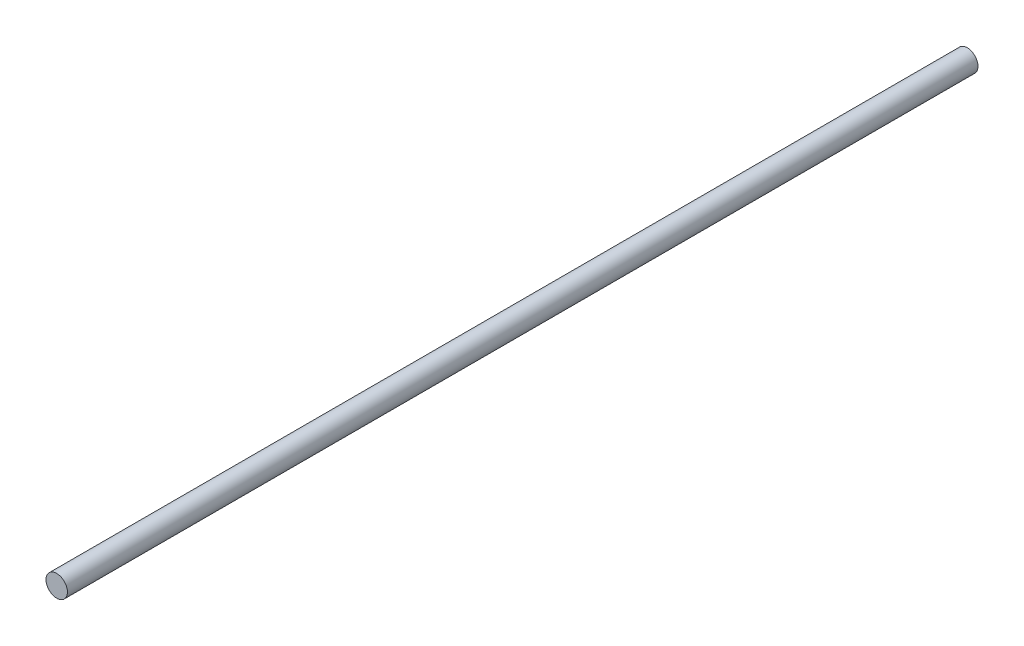
ISO-10303-21;
HEADER;
FILE_DESCRIPTION(('STEP AP214'),'2;1');
FILE_NAME('part.step','',(''),(''),'','','');
FILE_SCHEMA(('AUTOMOTIVE_DESIGN { 1 0 10303 214 1 1 1 1 }'));
ENDSEC;
DATA;
#1=APPLICATION_CONTEXT('core data for automotive mechanical design processes');
#2=APPLICATION_PROTOCOL_DEFINITION('international standard','automotive_design',2000,#1);
#3=PRODUCT_CONTEXT('',#1,'mechanical');
#4=PRODUCT('Part','Part','',(#3));
#5=PRODUCT_RELATED_PRODUCT_CATEGORY('part','',(#4));
#6=PRODUCT_DEFINITION_FORMATION('','',#4);
#7=PRODUCT_DEFINITION_CONTEXT('part definition',#1,'design');
#8=PRODUCT_DEFINITION('design','',#6,#7);
#9=PRODUCT_DEFINITION_SHAPE('','',#8);
#10=(LENGTH_UNIT() NAMED_UNIT(*) SI_UNIT(.MILLI.,.METRE.));
#11=(NAMED_UNIT(*) PLANE_ANGLE_UNIT() SI_UNIT($,.RADIAN.));
#12=(NAMED_UNIT(*) SI_UNIT($,.STERADIAN.) SOLID_ANGLE_UNIT());
#13=UNCERTAINTY_MEASURE_WITH_UNIT(LENGTH_MEASURE(1.E-05),#10,'distance_accuracy_value','');
#14=(GEOMETRIC_REPRESENTATION_CONTEXT(3) GLOBAL_UNCERTAINTY_ASSIGNED_CONTEXT((#13)) GLOBAL_UNIT_ASSIGNED_CONTEXT((#10,
#11,#12)) REPRESENTATION_CONTEXT('',''));
#15=CARTESIAN_POINT('',(0.,0.,0.));
#16=DIRECTION('',(0.,0.,1.));
#17=DIRECTION('',(1.,0.,0.));
#18=AXIS2_PLACEMENT_3D('',#15,#16,#17);
#19=CARTESIAN_POINT('',(0.,0.,509.05));
#20=DIRECTION('',(0.,0.,-1.));
#21=DIRECTION('',(-1.,0.,0.));
#22=AXIS2_PLACEMENT_3D('',#19,#20,#21);
#23=CYLINDRICAL_SURFACE('',#22,6.);
#24=CARTESIAN_POINT('',(0.,0.,509.05));
#25=DIRECTION('',(0.,0.,1.));
#26=DIRECTION('',(1.,0.,0.));
#27=AXIS2_PLACEMENT_3D('',#24,#25,#26);
#28=CIRCLE('',#27,6.);
#29=CARTESIAN_POINT('',(6.,0.,509.05));
#30=VERTEX_POINT('',#29);
#31=EDGE_CURVE('E10',#30,#30,#28,.T.);
#32=ORIENTED_EDGE('',*,*,#31,.F.);
#33=EDGE_LOOP('',(#32));
#34=FACE_BOUND('',#33,.T.);
#35=CARTESIAN_POINT('',(0.,0.,0.));
#36=DIRECTION('',(0.,0.,1.));
#37=DIRECTION('',(1.,0.,0.));
#38=AXIS2_PLACEMENT_3D('',#35,#36,#37);
#39=CIRCLE('',#38,6.);
#40=CARTESIAN_POINT('',(6.,0.,0.));
#41=VERTEX_POINT('',#40);
#42=EDGE_CURVE('E44',#41,#41,#39,.T.);
#43=ORIENTED_EDGE('',*,*,#42,.T.);
#44=EDGE_LOOP('',(#43));
#45=FACE_BOUND('',#44,.T.);
#46=ADVANCED_FACE('F41',(#34,#45),#23,.T.);
#47=CARTESIAN_POINT('',(0.,0.,509.05));
#48=DIRECTION('',(0.,0.,1.));
#49=DIRECTION('',(1.,0.,0.));
#50=AXIS2_PLACEMENT_3D('',#47,#48,#49);
#51=PLANE('',#50);
#52=ORIENTED_EDGE('',*,*,#31,.T.);
#53=EDGE_LOOP('',(#52));
#54=FACE_BOUND('',#53,.T.);
#55=ADVANCED_FACE('F58',(#54),#51,.T.);
#56=CARTESIAN_POINT('',(0.,0.,0.));
#57=DIRECTION('',(0.,0.,1.));
#58=DIRECTION('',(1.,0.,0.));
#59=AXIS2_PLACEMENT_3D('',#56,#57,#58);
#60=PLANE('',#59);
#61=ORIENTED_EDGE('',*,*,#42,.F.);
#62=EDGE_LOOP('',(#61));
#63=FACE_BOUND('',#62,.T.);
#64=ADVANCED_FACE('F56',(#63),#60,.F.);
#65=CLOSED_SHELL('',(#46,#55,#64));
#66=MANIFOLD_SOLID_BREP('B2',#65);
#67=ADVANCED_BREP_SHAPE_REPRESENTATION('',(#18,#66),#14);
#68=SHAPE_DEFINITION_REPRESENTATION(#9,#67);
ENDSEC;
END-ISO-10303-21;
